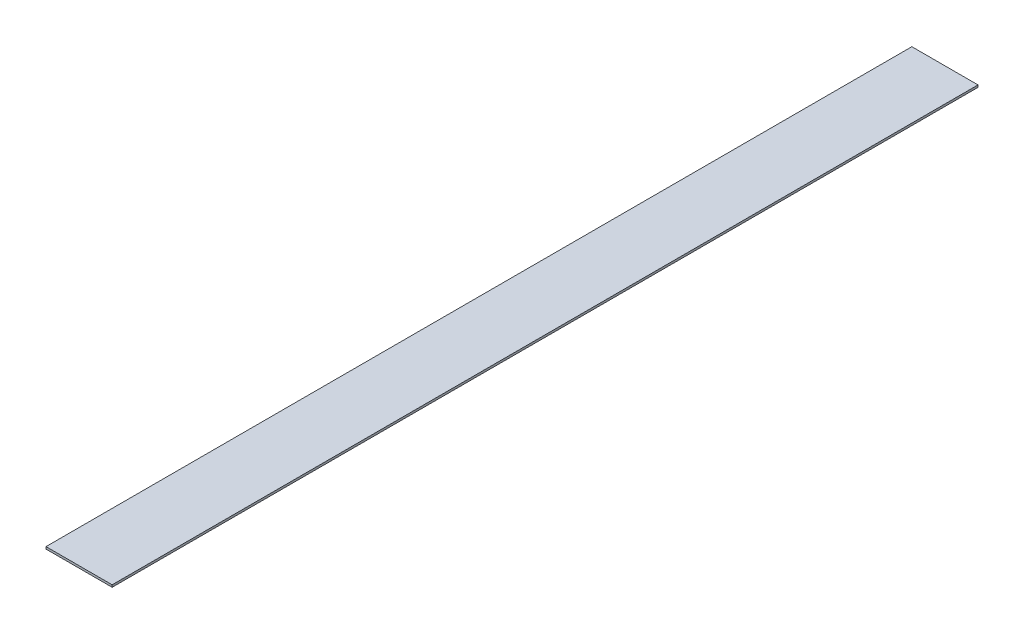
ISO-10303-21;
HEADER;
FILE_DESCRIPTION(('STEP AP214'),'2;1');
FILE_NAME('part.step','',(''),(''),'','','');
FILE_SCHEMA(('AUTOMOTIVE_DESIGN { 1 0 10303 214 1 1 1 1 }'));
ENDSEC;
DATA;
#1=APPLICATION_CONTEXT('core data for automotive mechanical design processes');
#2=APPLICATION_PROTOCOL_DEFINITION('international standard','automotive_design',2000,#1);
#3=PRODUCT_CONTEXT('',#1,'mechanical');
#4=PRODUCT('Part','Part','',(#3));
#5=PRODUCT_RELATED_PRODUCT_CATEGORY('part','',(#4));
#6=PRODUCT_DEFINITION_FORMATION('','',#4);
#7=PRODUCT_DEFINITION_CONTEXT('part definition',#1,'design');
#8=PRODUCT_DEFINITION('design','',#6,#7);
#9=PRODUCT_DEFINITION_SHAPE('','',#8);
#10=(LENGTH_UNIT() NAMED_UNIT(*) SI_UNIT(.MILLI.,.METRE.));
#11=(NAMED_UNIT(*) PLANE_ANGLE_UNIT() SI_UNIT($,.RADIAN.));
#12=(NAMED_UNIT(*) SI_UNIT($,.STERADIAN.) SOLID_ANGLE_UNIT());
#13=UNCERTAINTY_MEASURE_WITH_UNIT(LENGTH_MEASURE(1.E-05),#10,'distance_accuracy_value','');
#14=(GEOMETRIC_REPRESENTATION_CONTEXT(3) GLOBAL_UNCERTAINTY_ASSIGNED_CONTEXT((#13)) GLOBAL_UNIT_ASSIGNED_CONTEXT((#10,
#11,#12)) REPRESENTATION_CONTEXT('',''));
#15=CARTESIAN_POINT('',(0.,0.,0.));
#16=DIRECTION('',(0.,0.,1.));
#17=DIRECTION('',(1.,0.,0.));
#18=AXIS2_PLACEMENT_3D('',#15,#16,#17);
#19=CARTESIAN_POINT('',(23.114,-0.762,302.514));
#20=DIRECTION('',(-1.,0.,0.));
#21=DIRECTION('',(0.,0.,1.));
#22=AXIS2_PLACEMENT_3D('',#19,#20,#21);
#23=PLANE('',#22);
#24=DIRECTION('',(0.,1.,0.));
#25=VECTOR('',#24,1.);
#26=CARTESIAN_POINT('',(23.114,-0.762,-302.514));
#27=LINE('',#26,#25);
#28=CARTESIAN_POINT('',(23.114,-0.762,-302.514));
#29=VERTEX_POINT('',#28);
#30=CARTESIAN_POINT('',(23.114,0.762,-302.514));
#31=VERTEX_POINT('',#30);
#32=EDGE_CURVE('E99',#29,#31,#27,.T.);
#33=ORIENTED_EDGE('',*,*,#32,.T.);
#34=DIRECTION('',(0.,0.,-1.));
#35=VECTOR('',#34,1.);
#36=CARTESIAN_POINT('',(23.114,0.762,302.514));
#37=LINE('',#36,#35);
#38=CARTESIAN_POINT('',(23.114,0.762,302.514));
#39=VERTEX_POINT('',#38);
#40=EDGE_CURVE('E11',#39,#31,#37,.T.);
#41=ORIENTED_EDGE('',*,*,#40,.F.);
#42=DIRECTION('',(0.,1.,0.));
#43=VECTOR('',#42,1.);
#44=CARTESIAN_POINT('',(23.114,-0.762,302.514));
#45=LINE('',#44,#43);
#46=CARTESIAN_POINT('',(23.114,-0.762,302.514));
#47=VERTEX_POINT('',#46);
#48=EDGE_CURVE('E87',#47,#39,#45,.T.);
#49=ORIENTED_EDGE('',*,*,#48,.F.);
#50=DIRECTION('',(0.,0.,-1.));
#51=VECTOR('',#50,1.);
#52=CARTESIAN_POINT('',(23.114,-0.762,302.514));
#53=LINE('',#52,#51);
#54=EDGE_CURVE('E95',#47,#29,#53,.T.);
#55=ORIENTED_EDGE('',*,*,#54,.T.);
#56=EDGE_LOOP('',(#33,#41,#49,#55));
#57=FACE_BOUND('',#56,.T.);
#58=ADVANCED_FACE('F36',(#57),#23,.F.);
#59=CARTESIAN_POINT('',(-23.114,0.762,302.514));
#60=DIRECTION('',(0.,-1.,0.));
#61=DIRECTION('',(0.,0.,-1.));
#62=AXIS2_PLACEMENT_3D('',#59,#60,#61);
#63=PLANE('',#62);
#64=DIRECTION('',(-1.,0.,0.));
#65=VECTOR('',#64,1.);
#66=CARTESIAN_POINT('',(-23.114,0.762,-302.514));
#67=LINE('',#66,#65);
#68=CARTESIAN_POINT('',(-23.114,0.762,-302.514));
#69=VERTEX_POINT('',#68);
#70=EDGE_CURVE('E91',#31,#69,#67,.T.);
#71=ORIENTED_EDGE('',*,*,#70,.T.);
#72=DIRECTION('',(0.,0.,-1.));
#73=VECTOR('',#72,1.);
#74=CARTESIAN_POINT('',(-23.114,0.762,302.514));
#75=LINE('',#74,#73);
#76=CARTESIAN_POINT('',(-23.114,0.762,302.514));
#77=VERTEX_POINT('',#76);
#78=EDGE_CURVE('E44',#77,#69,#75,.T.);
#79=ORIENTED_EDGE('',*,*,#78,.F.);
#80=DIRECTION('',(-1.,0.,0.));
#81=VECTOR('',#80,1.);
#82=CARTESIAN_POINT('',(-23.114,0.762,302.514));
#83=LINE('',#82,#81);
#84=EDGE_CURVE('E82',#39,#77,#83,.T.);
#85=ORIENTED_EDGE('',*,*,#84,.F.);
#86=ORIENTED_EDGE('',*,*,#40,.T.);
#87=EDGE_LOOP('',(#71,#79,#85,#86));
#88=FACE_BOUND('',#87,.T.);
#89=ADVANCED_FACE('F90',(#88),#63,.F.);
#90=CARTESIAN_POINT('',(-23.114,-0.762,302.514));
#91=DIRECTION('',(1.,0.,0.));
#92=DIRECTION('',(0.,0.,-1.));
#93=AXIS2_PLACEMENT_3D('',#90,#91,#92);
#94=PLANE('',#93);
#95=DIRECTION('',(0.,-1.,0.));
#96=VECTOR('',#95,1.);
#97=CARTESIAN_POINT('',(-23.114,-0.762,-302.514));
#98=LINE('',#97,#96);
#99=CARTESIAN_POINT('',(-23.114,-0.762,-302.514));
#100=VERTEX_POINT('',#99);
#101=EDGE_CURVE('E69',#69,#100,#98,.T.);
#102=ORIENTED_EDGE('',*,*,#101,.T.);
#103=DIRECTION('',(0.,0.,-1.));
#104=VECTOR('',#103,1.);
#105=CARTESIAN_POINT('',(-23.114,-0.762,302.514));
#106=LINE('',#105,#104);
#107=CARTESIAN_POINT('',(-23.114,-0.762,302.514));
#108=VERTEX_POINT('',#107);
#109=EDGE_CURVE('E92',#108,#100,#106,.T.);
#110=ORIENTED_EDGE('',*,*,#109,.F.);
#111=DIRECTION('',(0.,-1.,0.));
#112=VECTOR('',#111,1.);
#113=CARTESIAN_POINT('',(-23.114,-0.762,302.514));
#114=LINE('',#113,#112);
#115=EDGE_CURVE('E85',#77,#108,#114,.T.);
#116=ORIENTED_EDGE('',*,*,#115,.F.);
#117=ORIENTED_EDGE('',*,*,#78,.T.);
#118=EDGE_LOOP('',(#102,#110,#116,#117));
#119=FACE_BOUND('',#118,.T.);
#120=ADVANCED_FACE('F93',(#119),#94,.F.);
#121=CARTESIAN_POINT('',(-23.114,-0.762,302.514));
#122=DIRECTION('',(0.,1.,0.));
#123=DIRECTION('',(0.,0.,1.));
#124=AXIS2_PLACEMENT_3D('',#121,#122,#123);
#125=PLANE('',#124);
#126=DIRECTION('',(1.,0.,0.));
#127=VECTOR('',#126,1.);
#128=CARTESIAN_POINT('',(-23.114,-0.762,-302.514));
#129=LINE('',#128,#127);
#130=EDGE_CURVE('E75',#100,#29,#129,.T.);
#131=ORIENTED_EDGE('',*,*,#130,.T.);
#132=ORIENTED_EDGE('',*,*,#54,.F.);
#133=DIRECTION('',(1.,0.,0.));
#134=VECTOR('',#133,1.);
#135=CARTESIAN_POINT('',(-23.114,-0.762,302.514));
#136=LINE('',#135,#134);
#137=EDGE_CURVE('E52',#108,#47,#136,.T.);
#138=ORIENTED_EDGE('',*,*,#137,.F.);
#139=ORIENTED_EDGE('',*,*,#109,.T.);
#140=EDGE_LOOP('',(#131,#132,#138,#139));
#141=FACE_BOUND('',#140,.T.);
#142=ADVANCED_FACE('F106',(#141),#125,.F.);
#143=CARTESIAN_POINT('',(0.,0.,302.514));
#144=DIRECTION('',(0.,0.,-1.));
#145=DIRECTION('',(-1.,0.,0.));
#146=AXIS2_PLACEMENT_3D('',#143,#144,#145);
#147=PLANE('',#146);
#148=ORIENTED_EDGE('',*,*,#48,.T.);
#149=ORIENTED_EDGE('',*,*,#84,.T.);
#150=ORIENTED_EDGE('',*,*,#115,.T.);
#151=ORIENTED_EDGE('',*,*,#137,.T.);
#152=EDGE_LOOP('',(#148,#149,#150,#151));
#153=FACE_BOUND('',#152,.T.);
#154=ADVANCED_FACE('F83',(#153),#147,.F.);
#155=CARTESIAN_POINT('',(0.,0.,-302.514));
#156=DIRECTION('',(0.,0.,-1.));
#157=DIRECTION('',(-1.,0.,0.));
#158=AXIS2_PLACEMENT_3D('',#155,#156,#157);
#159=PLANE('',#158);
#160=ORIENTED_EDGE('',*,*,#32,.F.);
#161=ORIENTED_EDGE('',*,*,#130,.F.);
#162=ORIENTED_EDGE('',*,*,#101,.F.);
#163=ORIENTED_EDGE('',*,*,#70,.F.);
#164=EDGE_LOOP('',(#160,#161,#162,#163));
#165=FACE_BOUND('',#164,.T.);
#166=ADVANCED_FACE('F109',(#165),#159,.T.);
#167=CLOSED_SHELL('',(#58,#89,#120,#142,#154,#166));
#168=MANIFOLD_SOLID_BREP('B2',#167);
#169=ADVANCED_BREP_SHAPE_REPRESENTATION('',(#18,#168),#14);
#170=SHAPE_DEFINITION_REPRESENTATION(#9,#169);
ENDSEC;
END-ISO-10303-21;
